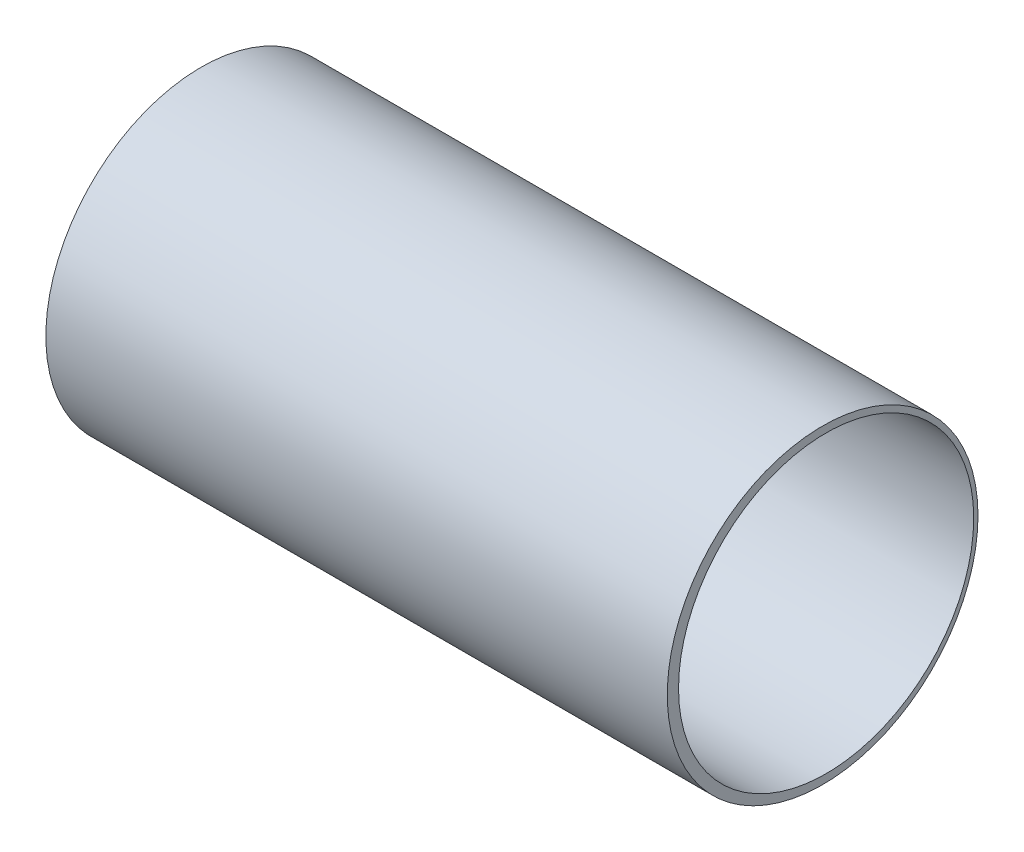
ISO-10303-21;
HEADER;
FILE_DESCRIPTION(('STEP AP214'),'2;1');
FILE_NAME('part.step','',(''),(''),'','','');
FILE_SCHEMA(('AUTOMOTIVE_DESIGN { 1 0 10303 214 1 1 1 1 }'));
ENDSEC;
DATA;
#1=APPLICATION_CONTEXT('core data for automotive mechanical design processes');
#2=APPLICATION_PROTOCOL_DEFINITION('international standard','automotive_design',2000,#1);
#3=PRODUCT_CONTEXT('',#1,'mechanical');
#4=PRODUCT('Part','Part','',(#3));
#5=PRODUCT_RELATED_PRODUCT_CATEGORY('part','',(#4));
#6=PRODUCT_DEFINITION_FORMATION('','',#4);
#7=PRODUCT_DEFINITION_CONTEXT('part definition',#1,'design');
#8=PRODUCT_DEFINITION('design','',#6,#7);
#9=PRODUCT_DEFINITION_SHAPE('','',#8);
#10=(LENGTH_UNIT() NAMED_UNIT(*) SI_UNIT(.MILLI.,.METRE.));
#11=(NAMED_UNIT(*) PLANE_ANGLE_UNIT() SI_UNIT($,.RADIAN.));
#12=(NAMED_UNIT(*) SI_UNIT($,.STERADIAN.) SOLID_ANGLE_UNIT());
#13=UNCERTAINTY_MEASURE_WITH_UNIT(LENGTH_MEASURE(1.E-05),#10,'distance_accuracy_value','');
#14=(GEOMETRIC_REPRESENTATION_CONTEXT(3) GLOBAL_UNCERTAINTY_ASSIGNED_CONTEXT((#13)) GLOBAL_UNIT_ASSIGNED_CONTEXT((#10,
#11,#12)) REPRESENTATION_CONTEXT('',''));
#15=CARTESIAN_POINT('',(0.,0.,0.));
#16=DIRECTION('',(0.,0.,1.));
#17=DIRECTION('',(1.,0.,0.));
#18=AXIS2_PLACEMENT_3D('',#15,#16,#17);
#19=CARTESIAN_POINT('',(-100.,0.,0.));
#20=DIRECTION('',(1.,0.,0.));
#21=DIRECTION('',(0.,0.,-1.));
#22=AXIS2_PLACEMENT_3D('',#19,#20,#21);
#23=CYLINDRICAL_SURFACE('',#22,50.);
#24=CARTESIAN_POINT('',(-100.,0.,0.));
#25=DIRECTION('',(1.,0.,0.));
#26=DIRECTION('',(0.,0.,-1.));
#27=AXIS2_PLACEMENT_3D('',#24,#25,#26);
#28=CIRCLE('',#27,50.);
#29=CARTESIAN_POINT('',(-100.,0.,-50.));
#30=VERTEX_POINT('',#29);
#31=EDGE_CURVE('E10',#30,#30,#28,.T.);
#32=ORIENTED_EDGE('',*,*,#31,.T.);
#33=EDGE_LOOP('',(#32));
#34=FACE_BOUND('',#33,.T.);
#35=CARTESIAN_POINT('',(100.,0.,0.));
#36=DIRECTION('',(1.,0.,0.));
#37=DIRECTION('',(0.,0.,-1.));
#38=AXIS2_PLACEMENT_3D('',#35,#36,#37);
#39=CIRCLE('',#38,50.);
#40=CARTESIAN_POINT('',(100.,0.,-50.));
#41=VERTEX_POINT('',#40);
#42=EDGE_CURVE('E40',#41,#41,#39,.T.);
#43=ORIENTED_EDGE('',*,*,#42,.F.);
#44=EDGE_LOOP('',(#43));
#45=FACE_BOUND('',#44,.T.);
#46=ADVANCED_FACE('F30',(#34,#45),#23,.T.);
#47=CARTESIAN_POINT('',(-100.,0.,0.));
#48=DIRECTION('',(1.,0.,0.));
#49=DIRECTION('',(0.,0.,-1.));
#50=AXIS2_PLACEMENT_3D('',#47,#48,#49);
#51=PLANE('',#50);
#52=CARTESIAN_POINT('',(-100.,0.,-1.120393070353));
#53=DIRECTION('',(1.,0.,0.));
#54=DIRECTION('',(0.,0.,-1.));
#55=AXIS2_PLACEMENT_3D('',#52,#53,#54);
#56=CIRCLE('',#55,47.5);
#57=CARTESIAN_POINT('',(-100.,0.,-48.620393070353));
#58=VERTEX_POINT('',#57);
#59=EDGE_CURVE('E36',#58,#58,#56,.T.);
#60=ORIENTED_EDGE('',*,*,#59,.T.);
#61=EDGE_LOOP('',(#60));
#62=FACE_BOUND('',#61,.T.);
#63=ORIENTED_EDGE('',*,*,#31,.F.);
#64=EDGE_LOOP('',(#63));
#65=FACE_BOUND('',#64,.T.);
#66=ADVANCED_FACE('F59',(#62,#65),#51,.F.);
#67=CARTESIAN_POINT('',(-100.,0.,-1.120393070353));
#68=DIRECTION('',(1.,0.,0.));
#69=DIRECTION('',(0.,0.,-1.));
#70=AXIS2_PLACEMENT_3D('',#67,#68,#69);
#71=CYLINDRICAL_SURFACE('',#70,47.5);
#72=ORIENTED_EDGE('',*,*,#59,.F.);
#73=EDGE_LOOP('',(#72));
#74=FACE_BOUND('',#73,.T.);
#75=CARTESIAN_POINT('',(100.,0.,-1.120393070353));
#76=DIRECTION('',(1.,0.,0.));
#77=DIRECTION('',(0.,0.,-1.));
#78=AXIS2_PLACEMENT_3D('',#75,#76,#77);
#79=CIRCLE('',#78,47.5);
#80=CARTESIAN_POINT('',(100.,0.,-48.620393070353));
#81=VERTEX_POINT('',#80);
#82=EDGE_CURVE('E44',#81,#81,#79,.T.);
#83=ORIENTED_EDGE('',*,*,#82,.T.);
#84=EDGE_LOOP('',(#83));
#85=FACE_BOUND('',#84,.T.);
#86=ADVANCED_FACE('F50',(#74,#85),#71,.F.);
#87=CARTESIAN_POINT('',(100.,0.,0.));
#88=DIRECTION('',(1.,0.,0.));
#89=DIRECTION('',(0.,0.,-1.));
#90=AXIS2_PLACEMENT_3D('',#87,#88,#89);
#91=PLANE('',#90);
#92=ORIENTED_EDGE('',*,*,#42,.T.);
#93=EDGE_LOOP('',(#92));
#94=FACE_BOUND('',#93,.T.);
#95=ORIENTED_EDGE('',*,*,#82,.F.);
#96=EDGE_LOOP('',(#95));
#97=FACE_BOUND('',#96,.T.);
#98=ADVANCED_FACE('F52',(#94,#97),#91,.T.);
#99=CLOSED_SHELL('',(#46,#66,#86,#98));
#100=MANIFOLD_SOLID_BREP('B2',#99);
#101=ADVANCED_BREP_SHAPE_REPRESENTATION('',(#18,#100),#14);
#102=SHAPE_DEFINITION_REPRESENTATION(#9,#101);
ENDSEC;
END-ISO-10303-21;
